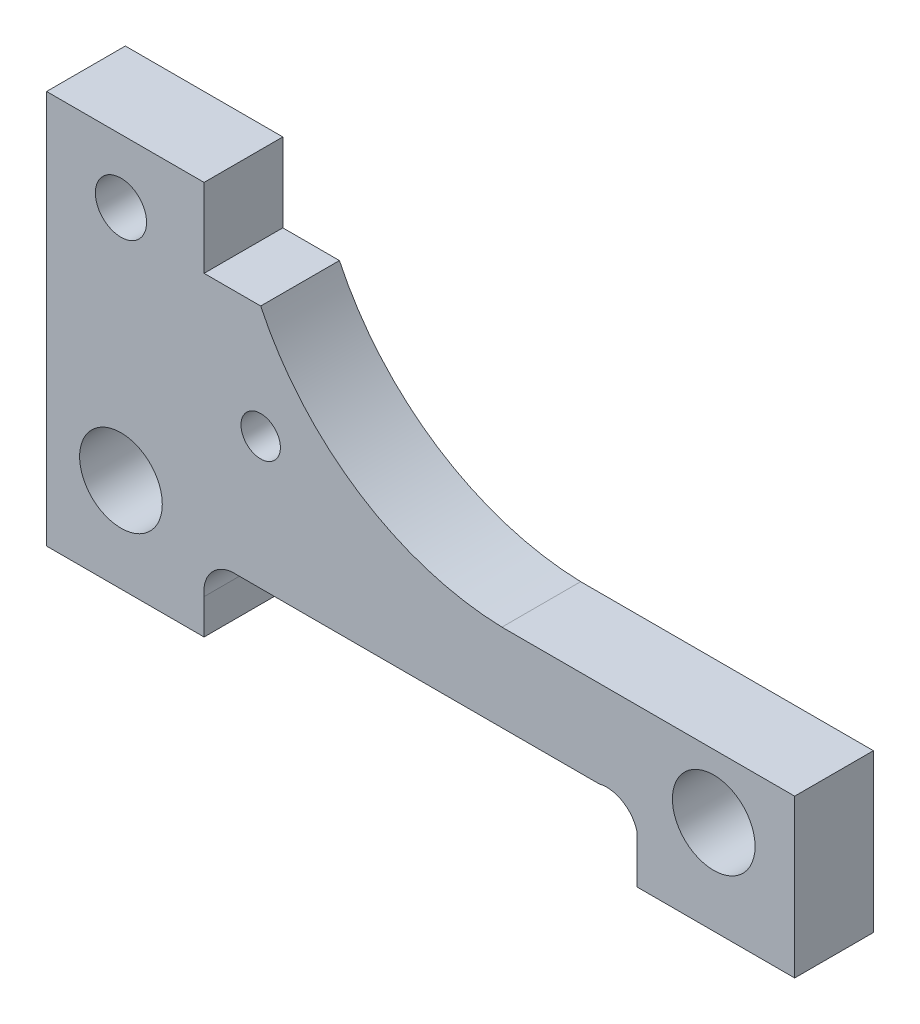
ISO-10303-21;
HEADER;
FILE_DESCRIPTION(('STEP AP214'),'2;1');
FILE_NAME('part.step','',(''),(''),'','','');
FILE_SCHEMA(('AUTOMOTIVE_DESIGN { 1 0 10303 214 1 1 1 1 }'));
ENDSEC;
DATA;
#1=APPLICATION_CONTEXT('core data for automotive mechanical design processes');
#2=APPLICATION_PROTOCOL_DEFINITION('international standard','automotive_design',2000,#1);
#3=PRODUCT_CONTEXT('',#1,'mechanical');
#4=PRODUCT('Part','Part','',(#3));
#5=PRODUCT_RELATED_PRODUCT_CATEGORY('part','',(#4));
#6=PRODUCT_DEFINITION_FORMATION('','',#4);
#7=PRODUCT_DEFINITION_CONTEXT('part definition',#1,'design');
#8=PRODUCT_DEFINITION('design','',#6,#7);
#9=PRODUCT_DEFINITION_SHAPE('','',#8);
#10=(LENGTH_UNIT() NAMED_UNIT(*) SI_UNIT(.MILLI.,.METRE.));
#11=(NAMED_UNIT(*) PLANE_ANGLE_UNIT() SI_UNIT($,.RADIAN.));
#12=(NAMED_UNIT(*) SI_UNIT($,.STERADIAN.) SOLID_ANGLE_UNIT());
#13=UNCERTAINTY_MEASURE_WITH_UNIT(LENGTH_MEASURE(1.E-05),#10,'distance_accuracy_value','');
#14=(GEOMETRIC_REPRESENTATION_CONTEXT(3) GLOBAL_UNCERTAINTY_ASSIGNED_CONTEXT((#13)) GLOBAL_UNIT_ASSIGNED_CONTEXT((#10,
#11,#12)) REPRESENTATION_CONTEXT('',''));
#15=CARTESIAN_POINT('',(0.,0.,0.));
#16=DIRECTION('',(0.,0.,1.));
#17=DIRECTION('',(1.,0.,0.));
#18=AXIS2_PLACEMENT_3D('',#15,#16,#17);
#19=CARTESIAN_POINT('',(-18.2562067385885,-2.81302459462369,10.));
#20=DIRECTION('',(0.,0.,-1.));
#21=DIRECTION('',(-1.,0.,0.));
#22=AXIS2_PLACEMENT_3D('',#19,#20,#21);
#23=PLANE('',#22);
#24=DIRECTION('',(1.,0.,0.));
#25=VECTOR('',#24,1.);
#26=CARTESIAN_POINT('',(-42.2222222222222,-7.77777777777778,10.));
#27=LINE('',#26,#25);
#28=CARTESIAN_POINT('',(-42.2222222222222,-7.77777777777778,10.));
#29=VERTEX_POINT('',#28);
#30=CARTESIAN_POINT('',(-22.2222222222222,-7.77777777777778,10.));
#31=VERTEX_POINT('',#30);
#32=EDGE_CURVE('E218',#29,#31,#27,.T.);
#33=ORIENTED_EDGE('',*,*,#32,.T.);
#34=DIRECTION('',(0.,1.,0.));
#35=VECTOR('',#34,1.);
#36=CARTESIAN_POINT('',(-22.2222222222222,-7.77777777777778,10.));
#37=LINE('',#36,#35);
#38=CARTESIAN_POINT('',(-22.2222222222222,-3.33333333333334,10.));
#39=VERTEX_POINT('',#38);
#40=EDGE_CURVE('E118',#31,#39,#37,.T.);
#41=ORIENTED_EDGE('',*,*,#40,.T.);
#42=CARTESIAN_POINT('',(-18.2562067385885,-2.81302459462369,10.));
#43=DIRECTION('',(0.,0.,-1.));
#44=DIRECTION('',(-1.,0.,0.));
#45=AXIS2_PLACEMENT_3D('',#42,#43,#44);
#46=CIRCLE('',#45,4.);
#47=CARTESIAN_POINT('',(-18.7765154772989,1.15299088900993,10.));
#48=VERTEX_POINT('',#47);
#49=EDGE_CURVE('E263',#39,#48,#46,.T.);
#50=ORIENTED_EDGE('',*,*,#49,.T.);
#51=DIRECTION('',(1.,0.,0.));
#52=VECTOR('',#51,1.);
#53=CARTESIAN_POINT('',(-18.7765154772989,1.15299088900993,10.));
#54=LINE('',#53,#52);
#55=CARTESIAN_POINT('',(27.9280447588084,1.15299088900993,10.));
#56=VERTEX_POINT('',#55);
#57=EDGE_CURVE('E283',#48,#56,#54,.T.);
#58=ORIENTED_EDGE('',*,*,#57,.T.);
#59=CARTESIAN_POINT('',(28.8968815944267,-2.72790529434117,10.));
#60=DIRECTION('',(0.,0.,-1.));
#61=DIRECTION('',(1.,0.,0.));
#62=AXIS2_PLACEMENT_3D('',#59,#60,#61);
#63=CIRCLE('',#62,4.);
#64=CARTESIAN_POINT('',(32.7777777777778,-1.75906845872289,10.));
#65=VERTEX_POINT('',#64);
#66=EDGE_CURVE('E279',#56,#65,#63,.T.);
#67=ORIENTED_EDGE('',*,*,#66,.T.);
#68=DIRECTION('',(0.,-1.,0.));
#69=VECTOR('',#68,1.);
#70=CARTESIAN_POINT('',(32.7777777777778,-7.77777777777778,10.));
#71=LINE('',#70,#69);
#72=CARTESIAN_POINT('',(32.7777777777778,-7.77777777777778,10.));
#73=VERTEX_POINT('',#72);
#74=EDGE_CURVE('E282',#65,#73,#71,.T.);
#75=ORIENTED_EDGE('',*,*,#74,.T.);
#76=DIRECTION('',(1.,0.,0.));
#77=VECTOR('',#76,1.);
#78=CARTESIAN_POINT('',(32.7777777777778,-7.77777777777778,10.));
#79=LINE('',#78,#77);
#80=CARTESIAN_POINT('',(52.7777777777778,-7.77777777777778,10.));
#81=VERTEX_POINT('',#80);
#82=EDGE_CURVE('E287',#73,#81,#79,.T.);
#83=ORIENTED_EDGE('',*,*,#82,.T.);
#84=DIRECTION('',(0.,1.,0.));
#85=VECTOR('',#84,1.);
#86=CARTESIAN_POINT('',(52.7777777777778,-7.77777777777778,10.));
#87=LINE('',#86,#85);
#88=CARTESIAN_POINT('',(52.7777777777778,12.2222222222222,10.));
#89=VERTEX_POINT('',#88);
#90=EDGE_CURVE('E294',#81,#89,#87,.T.);
#91=ORIENTED_EDGE('',*,*,#90,.T.);
#92=DIRECTION('',(-1.,0.,0.));
#93=VECTOR('',#92,1.);
#94=CARTESIAN_POINT('',(52.7777777777778,12.2222222222222,10.));
#95=LINE('',#94,#93);
#96=CARTESIAN_POINT('',(15.6024275495649,12.2222222222222,10.));
#97=VERTEX_POINT('',#96);
#98=EDGE_CURVE('E297',#89,#97,#95,.T.);
#99=ORIENTED_EDGE('',*,*,#98,.T.);
#100=CARTESIAN_POINT('',(16.5959748530596,47.2081174338031,10.));
#101=DIRECTION('',(0.,0.,-1.));
#102=DIRECTION('',(1.,0.,0.));
#103=AXIS2_PLACEMENT_3D('',#100,#101,#102);
#104=CIRCLE('',#103,35.);
#105=CARTESIAN_POINT('',(-15.0334883846801,32.2222222222222,10.));
#106=VERTEX_POINT('',#105);
#107=EDGE_CURVE('E300',#97,#106,#104,.T.);
#108=ORIENTED_EDGE('',*,*,#107,.T.);
#109=DIRECTION('',(-1.,0.,0.));
#110=VECTOR('',#109,1.);
#111=CARTESIAN_POINT('',(-22.2222222222222,32.2222222222222,10.));
#112=LINE('',#111,#110);
#113=CARTESIAN_POINT('',(-22.2222222222222,32.2222222222222,10.));
#114=VERTEX_POINT('',#113);
#115=EDGE_CURVE('E155',#106,#114,#112,.T.);
#116=ORIENTED_EDGE('',*,*,#115,.T.);
#117=DIRECTION('',(0.,1.,0.));
#118=VECTOR('',#117,1.);
#119=CARTESIAN_POINT('',(-22.2222222222222,42.2222222222222,10.));
#120=LINE('',#119,#118);
#121=CARTESIAN_POINT('',(-22.2222222222222,42.2222222222222,10.));
#122=VERTEX_POINT('',#121);
#123=EDGE_CURVE('E149',#114,#122,#120,.T.);
#124=ORIENTED_EDGE('',*,*,#123,.T.);
#125=DIRECTION('',(-1.,0.,0.));
#126=VECTOR('',#125,1.);
#127=CARTESIAN_POINT('',(-42.2222222222222,42.2222222222222,10.));
#128=LINE('',#127,#126);
#129=CARTESIAN_POINT('',(-42.2222222222222,42.2222222222222,10.));
#130=VERTEX_POINT('',#129);
#131=EDGE_CURVE('E153',#122,#130,#128,.T.);
#132=ORIENTED_EDGE('',*,*,#131,.T.);
#133=DIRECTION('',(0.,-1.,0.));
#134=VECTOR('',#133,1.);
#135=CARTESIAN_POINT('',(-42.2222222222222,-7.77777777777778,10.));
#136=LINE('',#135,#134);
#137=EDGE_CURVE('E57',#130,#29,#136,.T.);
#138=ORIENTED_EDGE('',*,*,#137,.T.);
#139=EDGE_LOOP('',(#33,#41,#50,#58,#67,#75,#83,#91,#99,#108,#116,#124,#132,#138));
#140=FACE_BOUND('',#139,.T.);
#141=CARTESIAN_POINT('',(-32.7777777777778,34.1666666666667,10.));
#142=DIRECTION('',(0.,0.,1.));
#143=DIRECTION('',(1.,0.,0.));
#144=AXIS2_PLACEMENT_3D('',#141,#142,#143);
#145=CIRCLE('',#144,3.25);
#146=CARTESIAN_POINT('',(-29.5277777777778,34.1666666666667,10.));
#147=VERTEX_POINT('',#146);
#148=EDGE_CURVE('E182',#147,#147,#145,.T.);
#149=ORIENTED_EDGE('',*,*,#148,.F.);
#150=EDGE_LOOP('',(#149));
#151=FACE_BOUND('',#150,.T.);
#152=CARTESIAN_POINT('',(-32.7777777777778,4.16666666666667,10.));
#153=DIRECTION('',(0.,0.,1.));
#154=DIRECTION('',(1.,0.,0.));
#155=AXIS2_PLACEMENT_3D('',#152,#153,#154);
#156=CIRCLE('',#155,5.25);
#157=CARTESIAN_POINT('',(-27.5277777777778,4.16666666666667,10.));
#158=VERTEX_POINT('',#157);
#159=EDGE_CURVE('E370',#158,#158,#156,.T.);
#160=ORIENTED_EDGE('',*,*,#159,.F.);
#161=EDGE_LOOP('',(#160));
#162=FACE_BOUND('',#161,.T.);
#163=CARTESIAN_POINT('',(-15.03348838468,17.9005280445915,10.));
#164=DIRECTION('',(0.,0.,1.));
#165=DIRECTION('',(1.,0.,0.));
#166=AXIS2_PLACEMENT_3D('',#163,#164,#165);
#167=CIRCLE('',#166,2.5);
#168=CARTESIAN_POINT('',(-12.53348838468,17.9005280445915,10.));
#169=VERTEX_POINT('',#168);
#170=EDGE_CURVE('E362',#169,#169,#167,.T.);
#171=ORIENTED_EDGE('',*,*,#170,.F.);
#172=EDGE_LOOP('',(#171));
#173=FACE_BOUND('',#172,.T.);
#174=CARTESIAN_POINT('',(42.5,4.16666666666667,10.));
#175=DIRECTION('',(0.,0.,1.));
#176=DIRECTION('',(1.,0.,0.));
#177=AXIS2_PLACEMENT_3D('',#174,#175,#176);
#178=CIRCLE('',#177,5.25);
#179=CARTESIAN_POINT('',(47.75,4.16666666666667,10.));
#180=VERTEX_POINT('',#179);
#181=EDGE_CURVE('E351',#180,#180,#178,.T.);
#182=ORIENTED_EDGE('',*,*,#181,.F.);
#183=EDGE_LOOP('',(#182));
#184=FACE_BOUND('',#183,.T.);
#185=ADVANCED_FACE('F39',(#140,#151,#162,#173,#184),#23,.F.);
#186=CARTESIAN_POINT('',(-18.2562067385885,-2.81302459462369,0.));
#187=DIRECTION('',(0.,0.,-1.));
#188=DIRECTION('',(-1.,0.,0.));
#189=AXIS2_PLACEMENT_3D('',#186,#187,#188);
#190=PLANE('',#189);
#191=CARTESIAN_POINT('',(-15.03348838468,17.9005280445915,0.));
#192=DIRECTION('',(0.,0.,1.));
#193=DIRECTION('',(1.,0.,0.));
#194=AXIS2_PLACEMENT_3D('',#191,#192,#193);
#195=CIRCLE('',#194,2.5);
#196=CARTESIAN_POINT('',(-12.53348838468,17.9005280445915,0.));
#197=VERTEX_POINT('',#196);
#198=EDGE_CURVE('E359',#197,#197,#195,.T.);
#199=ORIENTED_EDGE('',*,*,#198,.T.);
#200=EDGE_LOOP('',(#199));
#201=FACE_BOUND('',#200,.T.);
#202=CARTESIAN_POINT('',(-32.7777777777778,34.1666666666667,0.));
#203=DIRECTION('',(0.,0.,1.));
#204=DIRECTION('',(1.,0.,0.));
#205=AXIS2_PLACEMENT_3D('',#202,#203,#204);
#206=CIRCLE('',#205,3.25);
#207=CARTESIAN_POINT('',(-29.5277777777778,34.1666666666667,0.));
#208=VERTEX_POINT('',#207);
#209=EDGE_CURVE('E374',#208,#208,#206,.T.);
#210=ORIENTED_EDGE('',*,*,#209,.T.);
#211=EDGE_LOOP('',(#210));
#212=FACE_BOUND('',#211,.T.);
#213=DIRECTION('',(1.,0.,0.));
#214=VECTOR('',#213,1.);
#215=CARTESIAN_POINT('',(-42.2222222222222,-7.77777777777778,0.));
#216=LINE('',#215,#214);
#217=CARTESIAN_POINT('',(-42.2222222222222,-7.77777777777778,0.));
#218=VERTEX_POINT('',#217);
#219=CARTESIAN_POINT('',(-22.2222222222222,-7.77777777777778,0.));
#220=VERTEX_POINT('',#219);
#221=EDGE_CURVE('E177',#218,#220,#216,.T.);
#222=ORIENTED_EDGE('',*,*,#221,.F.);
#223=DIRECTION('',(0.,-1.,0.));
#224=VECTOR('',#223,1.);
#225=CARTESIAN_POINT('',(-42.2222222222222,-7.77777777777778,0.));
#226=LINE('',#225,#224);
#227=CARTESIAN_POINT('',(-42.2222222222222,42.2222222222222,0.));
#228=VERTEX_POINT('',#227);
#229=EDGE_CURVE('E110',#228,#218,#226,.T.);
#230=ORIENTED_EDGE('',*,*,#229,.F.);
#231=DIRECTION('',(-1.,0.,0.));
#232=VECTOR('',#231,1.);
#233=CARTESIAN_POINT('',(-42.2222222222222,42.2222222222222,0.));
#234=LINE('',#233,#232);
#235=CARTESIAN_POINT('',(-22.2222222222222,42.2222222222222,0.));
#236=VERTEX_POINT('',#235);
#237=EDGE_CURVE('E104',#236,#228,#234,.T.);
#238=ORIENTED_EDGE('',*,*,#237,.F.);
#239=DIRECTION('',(0.,1.,0.));
#240=VECTOR('',#239,1.);
#241=CARTESIAN_POINT('',(-22.2222222222222,42.2222222222222,0.));
#242=LINE('',#241,#240);
#243=CARTESIAN_POINT('',(-22.2222222222222,32.2222222222222,0.));
#244=VERTEX_POINT('',#243);
#245=EDGE_CURVE('E164',#244,#236,#242,.T.);
#246=ORIENTED_EDGE('',*,*,#245,.F.);
#247=DIRECTION('',(-1.,0.,0.));
#248=VECTOR('',#247,1.);
#249=CARTESIAN_POINT('',(-22.2222222222222,32.2222222222222,0.));
#250=LINE('',#249,#248);
#251=CARTESIAN_POINT('',(-15.0334883846801,32.2222222222222,0.));
#252=VERTEX_POINT('',#251);
#253=EDGE_CURVE('E209',#252,#244,#250,.T.);
#254=ORIENTED_EDGE('',*,*,#253,.F.);
#255=CARTESIAN_POINT('',(16.5959748530596,47.2081174338031,0.));
#256=DIRECTION('',(0.,0.,-1.));
#257=DIRECTION('',(1.,0.,0.));
#258=AXIS2_PLACEMENT_3D('',#255,#256,#257);
#259=CIRCLE('',#258,35.);
#260=CARTESIAN_POINT('',(15.6024275495649,12.2222222222222,0.));
#261=VERTEX_POINT('',#260);
#262=EDGE_CURVE('E206',#261,#252,#259,.T.);
#263=ORIENTED_EDGE('',*,*,#262,.F.);
#264=DIRECTION('',(-1.,0.,0.));
#265=VECTOR('',#264,1.);
#266=CARTESIAN_POINT('',(52.7777777777778,12.2222222222222,0.));
#267=LINE('',#266,#265);
#268=CARTESIAN_POINT('',(52.7777777777778,12.2222222222222,0.));
#269=VERTEX_POINT('',#268);
#270=EDGE_CURVE('E203',#269,#261,#267,.T.);
#271=ORIENTED_EDGE('',*,*,#270,.F.);
#272=DIRECTION('',(0.,1.,0.));
#273=VECTOR('',#272,1.);
#274=CARTESIAN_POINT('',(52.7777777777778,-7.77777777777778,0.));
#275=LINE('',#274,#273);
#276=CARTESIAN_POINT('',(52.7777777777778,-7.77777777777778,0.));
#277=VERTEX_POINT('',#276);
#278=EDGE_CURVE('E200',#277,#269,#275,.T.);
#279=ORIENTED_EDGE('',*,*,#278,.F.);
#280=DIRECTION('',(1.,0.,0.));
#281=VECTOR('',#280,1.);
#282=CARTESIAN_POINT('',(32.7777777777778,-7.77777777777778,0.));
#283=LINE('',#282,#281);
#284=CARTESIAN_POINT('',(32.7777777777778,-7.77777777777778,0.));
#285=VERTEX_POINT('',#284);
#286=EDGE_CURVE('E197',#285,#277,#283,.T.);
#287=ORIENTED_EDGE('',*,*,#286,.F.);
#288=DIRECTION('',(0.,-1.,0.));
#289=VECTOR('',#288,1.);
#290=CARTESIAN_POINT('',(32.7777777777778,-7.77777777777778,0.));
#291=LINE('',#290,#289);
#292=CARTESIAN_POINT('',(32.7777777777778,-1.75906845872289,0.));
#293=VERTEX_POINT('',#292);
#294=EDGE_CURVE('E194',#293,#285,#291,.T.);
#295=ORIENTED_EDGE('',*,*,#294,.F.);
#296=CARTESIAN_POINT('',(28.8968815944267,-2.72790529434117,0.));
#297=DIRECTION('',(0.,0.,-1.));
#298=DIRECTION('',(1.,0.,0.));
#299=AXIS2_PLACEMENT_3D('',#296,#297,#298);
#300=CIRCLE('',#299,4.);
#301=CARTESIAN_POINT('',(27.9280447588084,1.15299088900993,0.));
#302=VERTEX_POINT('',#301);
#303=EDGE_CURVE('E191',#302,#293,#300,.T.);
#304=ORIENTED_EDGE('',*,*,#303,.F.);
#305=DIRECTION('',(1.,0.,0.));
#306=VECTOR('',#305,1.);
#307=CARTESIAN_POINT('',(-18.7765154772989,1.15299088900993,0.));
#308=LINE('',#307,#306);
#309=CARTESIAN_POINT('',(-18.7765154772989,1.15299088900993,0.));
#310=VERTEX_POINT('',#309);
#311=EDGE_CURVE('E188',#310,#302,#308,.T.);
#312=ORIENTED_EDGE('',*,*,#311,.F.);
#313=CARTESIAN_POINT('',(-18.2562067385885,-2.81302459462369,0.));
#314=DIRECTION('',(0.,0.,-1.));
#315=DIRECTION('',(-1.,0.,0.));
#316=AXIS2_PLACEMENT_3D('',#313,#314,#315);
#317=CIRCLE('',#316,4.);
#318=CARTESIAN_POINT('',(-22.2222222222222,-3.33333333333334,0.));
#319=VERTEX_POINT('',#318);
#320=EDGE_CURVE('E185',#319,#310,#317,.T.);
#321=ORIENTED_EDGE('',*,*,#320,.F.);
#322=DIRECTION('',(0.,1.,0.));
#323=VECTOR('',#322,1.);
#324=CARTESIAN_POINT('',(-22.2222222222222,-7.77777777777778,0.));
#325=LINE('',#324,#323);
#326=EDGE_CURVE('E181',#220,#319,#325,.T.);
#327=ORIENTED_EDGE('',*,*,#326,.F.);
#328=EDGE_LOOP('',(#222,#230,#238,#246,#254,#263,#271,#279,#287,#295,#304,#312,#321,#327));
#329=FACE_BOUND('',#328,.T.);
#330=CARTESIAN_POINT('',(-32.7777777777778,4.16666666666667,0.));
#331=DIRECTION('',(0.,0.,1.));
#332=DIRECTION('',(1.,0.,0.));
#333=AXIS2_PLACEMENT_3D('',#330,#331,#332);
#334=CIRCLE('',#333,5.25);
#335=CARTESIAN_POINT('',(-27.5277777777778,4.16666666666667,0.));
#336=VERTEX_POINT('',#335);
#337=EDGE_CURVE('E366',#336,#336,#334,.T.);
#338=ORIENTED_EDGE('',*,*,#337,.T.);
#339=EDGE_LOOP('',(#338));
#340=FACE_BOUND('',#339,.T.);
#341=CARTESIAN_POINT('',(42.5,4.16666666666667,0.));
#342=DIRECTION('',(0.,0.,1.));
#343=DIRECTION('',(1.,0.,0.));
#344=AXIS2_PLACEMENT_3D('',#341,#342,#343);
#345=CIRCLE('',#344,5.25);
#346=CARTESIAN_POINT('',(47.75,4.16666666666667,0.));
#347=VERTEX_POINT('',#346);
#348=EDGE_CURVE('E354',#347,#347,#345,.T.);
#349=ORIENTED_EDGE('',*,*,#348,.T.);
#350=EDGE_LOOP('',(#349));
#351=FACE_BOUND('',#350,.T.);
#352=ADVANCED_FACE('F267',(#201,#212,#329,#340,#351),#190,.T.);
#353=CARTESIAN_POINT('',(-42.2222222222222,-7.77777777777778,10.));
#354=DIRECTION('',(0.,1.,0.));
#355=DIRECTION('',(0.,0.,1.));
#356=AXIS2_PLACEMENT_3D('',#353,#354,#355);
#357=PLANE('',#356);
#358=ORIENTED_EDGE('',*,*,#221,.T.);
#359=DIRECTION('',(0.,0.,-1.));
#360=VECTOR('',#359,1.);
#361=CARTESIAN_POINT('',(-22.2222222222222,-7.77777777777778,10.));
#362=LINE('',#361,#360);
#363=EDGE_CURVE('E11',#31,#220,#362,.T.);
#364=ORIENTED_EDGE('',*,*,#363,.F.);
#365=ORIENTED_EDGE('',*,*,#32,.F.);
#366=DIRECTION('',(0.,0.,-1.));
#367=VECTOR('',#366,1.);
#368=CARTESIAN_POINT('',(-42.2222222222222,-7.77777777777778,10.));
#369=LINE('',#368,#367);
#370=EDGE_CURVE('E173',#29,#218,#369,.T.);
#371=ORIENTED_EDGE('',*,*,#370,.T.);
#372=EDGE_LOOP('',(#358,#364,#365,#371));
#373=FACE_BOUND('',#372,.T.);
#374=ADVANCED_FACE('F41',(#373),#357,.F.);
#375=CARTESIAN_POINT('',(-22.2222222222222,-7.77777777777778,10.));
#376=DIRECTION('',(-1.,0.,0.));
#377=DIRECTION('',(0.,0.,1.));
#378=AXIS2_PLACEMENT_3D('',#375,#376,#377);
#379=PLANE('',#378);
#380=ORIENTED_EDGE('',*,*,#326,.T.);
#381=DIRECTION('',(0.,0.,-1.));
#382=VECTOR('',#381,1.);
#383=CARTESIAN_POINT('',(-22.2222222222222,-3.33333333333334,10.));
#384=LINE('',#383,#382);
#385=EDGE_CURVE('E49',#39,#319,#384,.T.);
#386=ORIENTED_EDGE('',*,*,#385,.F.);
#387=ORIENTED_EDGE('',*,*,#40,.F.);
#388=ORIENTED_EDGE('',*,*,#363,.T.);
#389=EDGE_LOOP('',(#380,#386,#387,#388));
#390=FACE_BOUND('',#389,.T.);
#391=ADVANCED_FACE('F512',(#390),#379,.F.);
#392=CARTESIAN_POINT('',(-18.2562067385885,-2.81302459462369,10.));
#393=DIRECTION('',(0.,0.,-1.));
#394=DIRECTION('',(-1.,0.,0.));
#395=AXIS2_PLACEMENT_3D('',#392,#393,#394);
#396=CYLINDRICAL_SURFACE('',#395,4.);
#397=ORIENTED_EDGE('',*,*,#320,.T.);
#398=DIRECTION('',(0.,0.,-1.));
#399=VECTOR('',#398,1.);
#400=CARTESIAN_POINT('',(-18.7765154772989,1.15299088900993,10.));
#401=LINE('',#400,#399);
#402=EDGE_CURVE('E253',#48,#310,#401,.T.);
#403=ORIENTED_EDGE('',*,*,#402,.F.);
#404=ORIENTED_EDGE('',*,*,#49,.F.);
#405=ORIENTED_EDGE('',*,*,#385,.T.);
#406=EDGE_LOOP('',(#397,#403,#404,#405));
#407=FACE_BOUND('',#406,.T.);
#408=ADVANCED_FACE('F261',(#407),#396,.F.);
#409=CARTESIAN_POINT('',(-18.7765154772989,1.15299088900993,10.));
#410=DIRECTION('',(0.,1.,0.));
#411=DIRECTION('',(0.,0.,1.));
#412=AXIS2_PLACEMENT_3D('',#409,#410,#411);
#413=PLANE('',#412);
#414=ORIENTED_EDGE('',*,*,#311,.T.);
#415=DIRECTION('',(0.,0.,-1.));
#416=VECTOR('',#415,1.);
#417=CARTESIAN_POINT('',(27.9280447588084,1.15299088900993,10.));
#418=LINE('',#417,#416);
#419=EDGE_CURVE('E249',#56,#302,#418,.T.);
#420=ORIENTED_EDGE('',*,*,#419,.F.);
#421=ORIENTED_EDGE('',*,*,#57,.F.);
#422=ORIENTED_EDGE('',*,*,#402,.T.);
#423=EDGE_LOOP('',(#414,#420,#421,#422));
#424=FACE_BOUND('',#423,.T.);
#425=ADVANCED_FACE('F273',(#424),#413,.F.);
#426=CARTESIAN_POINT('',(28.8968815944267,-2.72790529434117,10.));
#427=DIRECTION('',(0.,0.,-1.));
#428=DIRECTION('',(-1.,0.,0.));
#429=AXIS2_PLACEMENT_3D('',#426,#427,#428);
#430=CYLINDRICAL_SURFACE('',#429,4.);
#431=ORIENTED_EDGE('',*,*,#303,.T.);
#432=DIRECTION('',(0.,0.,-1.));
#433=VECTOR('',#432,1.);
#434=CARTESIAN_POINT('',(32.7777777777778,-1.75906845872289,10.));
#435=LINE('',#434,#433);
#436=EDGE_CURVE('E245',#65,#293,#435,.T.);
#437=ORIENTED_EDGE('',*,*,#436,.F.);
#438=ORIENTED_EDGE('',*,*,#66,.F.);
#439=ORIENTED_EDGE('',*,*,#419,.T.);
#440=EDGE_LOOP('',(#431,#437,#438,#439));
#441=FACE_BOUND('',#440,.T.);
#442=ADVANCED_FACE('F277',(#441),#430,.F.);
#443=CARTESIAN_POINT('',(32.7777777777778,-7.77777777777778,10.));
#444=DIRECTION('',(1.,0.,0.));
#445=DIRECTION('',(0.,0.,-1.));
#446=AXIS2_PLACEMENT_3D('',#443,#444,#445);
#447=PLANE('',#446);
#448=ORIENTED_EDGE('',*,*,#294,.T.);
#449=DIRECTION('',(0.,0.,-1.));
#450=VECTOR('',#449,1.);
#451=CARTESIAN_POINT('',(32.7777777777778,-7.77777777777778,10.));
#452=LINE('',#451,#450);
#453=EDGE_CURVE('E241',#73,#285,#452,.T.);
#454=ORIENTED_EDGE('',*,*,#453,.F.);
#455=ORIENTED_EDGE('',*,*,#74,.F.);
#456=ORIENTED_EDGE('',*,*,#436,.T.);
#457=EDGE_LOOP('',(#448,#454,#455,#456));
#458=FACE_BOUND('',#457,.T.);
#459=ADVANCED_FACE('F477',(#458),#447,.F.);
#460=CARTESIAN_POINT('',(32.7777777777778,-7.77777777777778,10.));
#461=DIRECTION('',(0.,1.,0.));
#462=DIRECTION('',(0.,0.,1.));
#463=AXIS2_PLACEMENT_3D('',#460,#461,#462);
#464=PLANE('',#463);
#465=ORIENTED_EDGE('',*,*,#286,.T.);
#466=DIRECTION('',(0.,0.,-1.));
#467=VECTOR('',#466,1.);
#468=CARTESIAN_POINT('',(52.7777777777778,-7.77777777777778,10.));
#469=LINE('',#468,#467);
#470=EDGE_CURVE('E237',#81,#277,#469,.T.);
#471=ORIENTED_EDGE('',*,*,#470,.F.);
#472=ORIENTED_EDGE('',*,*,#82,.F.);
#473=ORIENTED_EDGE('',*,*,#453,.T.);
#474=EDGE_LOOP('',(#465,#471,#472,#473));
#475=FACE_BOUND('',#474,.T.);
#476=ADVANCED_FACE('F467',(#475),#464,.F.);
#477=CARTESIAN_POINT('',(52.7777777777778,-7.77777777777778,10.));
#478=DIRECTION('',(-1.,0.,0.));
#479=DIRECTION('',(0.,-1.,0.));
#480=AXIS2_PLACEMENT_3D('',#477,#478,#479);
#481=PLANE('',#480);
#482=ORIENTED_EDGE('',*,*,#278,.T.);
#483=DIRECTION('',(0.,0.,-1.));
#484=VECTOR('',#483,1.);
#485=CARTESIAN_POINT('',(52.7777777777778,12.2222222222222,10.));
#486=LINE('',#485,#484);
#487=EDGE_CURVE('E233',#89,#269,#486,.T.);
#488=ORIENTED_EDGE('',*,*,#487,.F.);
#489=ORIENTED_EDGE('',*,*,#90,.F.);
#490=ORIENTED_EDGE('',*,*,#470,.T.);
#491=EDGE_LOOP('',(#482,#488,#489,#490));
#492=FACE_BOUND('',#491,.T.);
#493=ADVANCED_FACE('F457',(#492),#481,.F.);
#494=CARTESIAN_POINT('',(52.7777777777778,12.2222222222222,10.));
#495=DIRECTION('',(0.,-1.,0.));
#496=DIRECTION('',(1.,0.,0.));
#497=AXIS2_PLACEMENT_3D('',#494,#495,#496);
#498=PLANE('',#497);
#499=ORIENTED_EDGE('',*,*,#270,.T.);
#500=DIRECTION('',(0.,0.,-1.));
#501=VECTOR('',#500,1.);
#502=CARTESIAN_POINT('',(15.6024275495649,12.2222222222222,10.));
#503=LINE('',#502,#501);
#504=EDGE_CURVE('E229',#97,#261,#503,.T.);
#505=ORIENTED_EDGE('',*,*,#504,.F.);
#506=ORIENTED_EDGE('',*,*,#98,.F.);
#507=ORIENTED_EDGE('',*,*,#487,.T.);
#508=EDGE_LOOP('',(#499,#505,#506,#507));
#509=FACE_BOUND('',#508,.T.);
#510=ADVANCED_FACE('F448',(#509),#498,.F.);
#511=CARTESIAN_POINT('',(16.5959748530596,47.2081174338031,10.));
#512=DIRECTION('',(0.,0.,-1.));
#513=DIRECTION('',(-1.,0.,0.));
#514=AXIS2_PLACEMENT_3D('',#511,#512,#513);
#515=CYLINDRICAL_SURFACE('',#514,35.);
#516=ORIENTED_EDGE('',*,*,#262,.T.);
#517=DIRECTION('',(0.,0.,-1.));
#518=VECTOR('',#517,1.);
#519=CARTESIAN_POINT('',(-15.0334883846801,32.2222222222222,10.));
#520=LINE('',#519,#518);
#521=EDGE_CURVE('E225',#106,#252,#520,.T.);
#522=ORIENTED_EDGE('',*,*,#521,.F.);
#523=ORIENTED_EDGE('',*,*,#107,.F.);
#524=ORIENTED_EDGE('',*,*,#504,.T.);
#525=EDGE_LOOP('',(#516,#522,#523,#524));
#526=FACE_BOUND('',#525,.T.);
#527=ADVANCED_FACE('F308',(#526),#515,.F.);
#528=CARTESIAN_POINT('',(-22.2222222222222,32.2222222222222,10.));
#529=DIRECTION('',(0.,-1.,0.));
#530=DIRECTION('',(1.,0.,0.));
#531=AXIS2_PLACEMENT_3D('',#528,#529,#530);
#532=PLANE('',#531);
#533=ORIENTED_EDGE('',*,*,#253,.T.);
#534=DIRECTION('',(0.,0.,-1.));
#535=VECTOR('',#534,1.);
#536=CARTESIAN_POINT('',(-22.2222222222222,32.2222222222222,10.));
#537=LINE('',#536,#535);
#538=EDGE_CURVE('E166',#114,#244,#537,.T.);
#539=ORIENTED_EDGE('',*,*,#538,.F.);
#540=ORIENTED_EDGE('',*,*,#115,.F.);
#541=ORIENTED_EDGE('',*,*,#521,.T.);
#542=EDGE_LOOP('',(#533,#539,#540,#541));
#543=FACE_BOUND('',#542,.T.);
#544=ADVANCED_FACE('F312',(#543),#532,.F.);
#545=CARTESIAN_POINT('',(-22.2222222222222,42.2222222222222,10.));
#546=DIRECTION('',(-1.,0.,0.));
#547=DIRECTION('',(0.,0.,1.));
#548=AXIS2_PLACEMENT_3D('',#545,#546,#547);
#549=PLANE('',#548);
#550=ORIENTED_EDGE('',*,*,#245,.T.);
#551=DIRECTION('',(0.,0.,-1.));
#552=VECTOR('',#551,1.);
#553=CARTESIAN_POINT('',(-22.2222222222222,42.2222222222222,10.));
#554=LINE('',#553,#552);
#555=EDGE_CURVE('E161',#122,#236,#554,.T.);
#556=ORIENTED_EDGE('',*,*,#555,.F.);
#557=ORIENTED_EDGE('',*,*,#123,.F.);
#558=ORIENTED_EDGE('',*,*,#538,.T.);
#559=EDGE_LOOP('',(#550,#556,#557,#558));
#560=FACE_BOUND('',#559,.T.);
#561=ADVANCED_FACE('F162',(#560),#549,.F.);
#562=CARTESIAN_POINT('',(-42.2222222222222,42.2222222222222,10.));
#563=DIRECTION('',(0.,-1.,0.));
#564=DIRECTION('',(0.,0.,-1.));
#565=AXIS2_PLACEMENT_3D('',#562,#563,#564);
#566=PLANE('',#565);
#567=ORIENTED_EDGE('',*,*,#237,.T.);
#568=DIRECTION('',(0.,0.,-1.));
#569=VECTOR('',#568,1.);
#570=CARTESIAN_POINT('',(-42.2222222222222,42.2222222222222,10.));
#571=LINE('',#570,#569);
#572=EDGE_CURVE('E167',#130,#228,#571,.T.);
#573=ORIENTED_EDGE('',*,*,#572,.F.);
#574=ORIENTED_EDGE('',*,*,#131,.F.);
#575=ORIENTED_EDGE('',*,*,#555,.T.);
#576=EDGE_LOOP('',(#567,#573,#574,#575));
#577=FACE_BOUND('',#576,.T.);
#578=ADVANCED_FACE('F169',(#577),#566,.F.);
#579=CARTESIAN_POINT('',(-42.2222222222222,-7.77777777777778,10.));
#580=DIRECTION('',(1.,0.,0.));
#581=DIRECTION('',(0.,0.,-1.));
#582=AXIS2_PLACEMENT_3D('',#579,#580,#581);
#583=PLANE('',#582);
#584=ORIENTED_EDGE('',*,*,#229,.T.);
#585=ORIENTED_EDGE('',*,*,#370,.F.);
#586=ORIENTED_EDGE('',*,*,#137,.F.);
#587=ORIENTED_EDGE('',*,*,#572,.T.);
#588=EDGE_LOOP('',(#584,#585,#586,#587));
#589=FACE_BOUND('',#588,.T.);
#590=ADVANCED_FACE('F316',(#589),#583,.F.);
#591=CARTESIAN_POINT('',(-32.7777777777778,34.1666666666667,10.));
#592=DIRECTION('',(0.,0.,-1.));
#593=DIRECTION('',(-1.,0.,0.));
#594=AXIS2_PLACEMENT_3D('',#591,#592,#593);
#595=CYLINDRICAL_SURFACE('',#594,3.25);
#596=ORIENTED_EDGE('',*,*,#148,.T.);
#597=EDGE_LOOP('',(#596));
#598=FACE_BOUND('',#597,.T.);
#599=ORIENTED_EDGE('',*,*,#209,.F.);
#600=EDGE_LOOP('',(#599));
#601=FACE_BOUND('',#600,.T.);
#602=ADVANCED_FACE('F318',(#598,#601),#595,.F.);
#603=CARTESIAN_POINT('',(-32.7777777777778,4.16666666666667,10.));
#604=DIRECTION('',(0.,0.,-1.));
#605=DIRECTION('',(-1.,0.,0.));
#606=AXIS2_PLACEMENT_3D('',#603,#604,#605);
#607=CYLINDRICAL_SURFACE('',#606,5.25);
#608=ORIENTED_EDGE('',*,*,#159,.T.);
#609=EDGE_LOOP('',(#608));
#610=FACE_BOUND('',#609,.T.);
#611=ORIENTED_EDGE('',*,*,#337,.F.);
#612=EDGE_LOOP('',(#611));
#613=FACE_BOUND('',#612,.T.);
#614=ADVANCED_FACE('F324',(#610,#613),#607,.F.);
#615=CARTESIAN_POINT('',(-15.03348838468,17.9005280445915,10.));
#616=DIRECTION('',(0.,0.,-1.));
#617=DIRECTION('',(-1.,0.,0.));
#618=AXIS2_PLACEMENT_3D('',#615,#616,#617);
#619=CYLINDRICAL_SURFACE('',#618,2.5);
#620=ORIENTED_EDGE('',*,*,#170,.T.);
#621=EDGE_LOOP('',(#620));
#622=FACE_BOUND('',#621,.T.);
#623=ORIENTED_EDGE('',*,*,#198,.F.);
#624=EDGE_LOOP('',(#623));
#625=FACE_BOUND('',#624,.T.);
#626=ADVANCED_FACE('F338',(#622,#625),#619,.F.);
#627=CARTESIAN_POINT('',(42.5,4.16666666666667,10.));
#628=DIRECTION('',(0.,0.,-1.));
#629=DIRECTION('',(-1.,0.,0.));
#630=AXIS2_PLACEMENT_3D('',#627,#628,#629);
#631=CYLINDRICAL_SURFACE('',#630,5.25);
#632=ORIENTED_EDGE('',*,*,#181,.T.);
#633=EDGE_LOOP('',(#632));
#634=FACE_BOUND('',#633,.T.);
#635=ORIENTED_EDGE('',*,*,#348,.F.);
#636=EDGE_LOOP('',(#635));
#637=FACE_BOUND('',#636,.T.);
#638=ADVANCED_FACE('F342',(#634,#637),#631,.F.);
#639=CLOSED_SHELL('',(#185,#352,#374,#391,#408,#425,#442,#459,#476,#493,#510,#527,#544,#561,
#578,#590,#602,#614,#626,#638));
#640=MANIFOLD_SOLID_BREP('B2',#639);
#641=ADVANCED_BREP_SHAPE_REPRESENTATION('',(#18,#640),#14);
#642=SHAPE_DEFINITION_REPRESENTATION(#9,#641);
ENDSEC;
END-ISO-10303-21;
